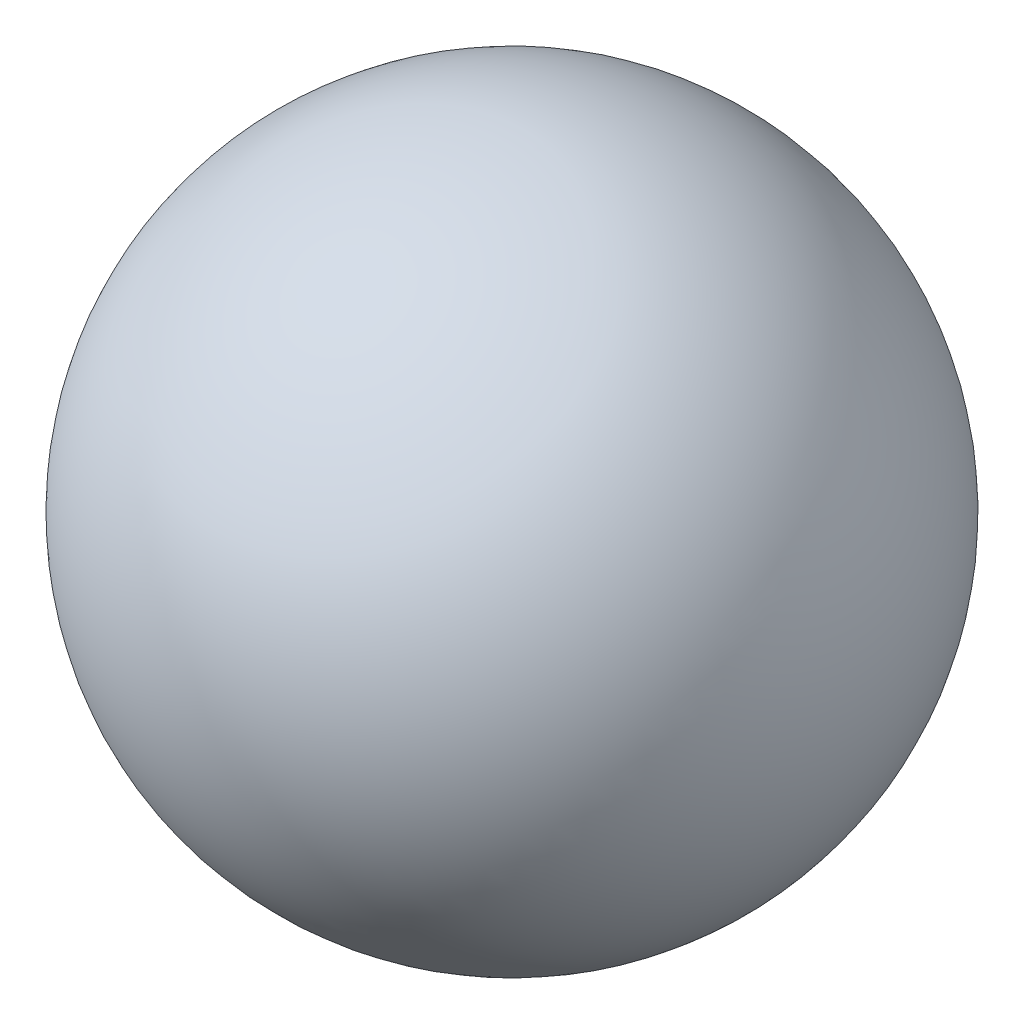
ISO-10303-21;
HEADER;
FILE_DESCRIPTION(('STEP AP214'),'2;1');
FILE_NAME('part.step','',(''),(''),'','','');
FILE_SCHEMA(('AUTOMOTIVE_DESIGN { 1 0 10303 214 1 1 1 1 }'));
ENDSEC;
DATA;
#1=APPLICATION_CONTEXT('core data for automotive mechanical design processes');
#2=APPLICATION_PROTOCOL_DEFINITION('international standard','automotive_design',2000,#1);
#3=PRODUCT_CONTEXT('',#1,'mechanical');
#4=PRODUCT('Part','Part','',(#3));
#5=PRODUCT_RELATED_PRODUCT_CATEGORY('part','',(#4));
#6=PRODUCT_DEFINITION_FORMATION('','',#4);
#7=PRODUCT_DEFINITION_CONTEXT('part definition',#1,'design');
#8=PRODUCT_DEFINITION('design','',#6,#7);
#9=PRODUCT_DEFINITION_SHAPE('','',#8);
#10=(LENGTH_UNIT() NAMED_UNIT(*) SI_UNIT(.MILLI.,.METRE.));
#11=(NAMED_UNIT(*) PLANE_ANGLE_UNIT() SI_UNIT($,.RADIAN.));
#12=(NAMED_UNIT(*) SI_UNIT($,.STERADIAN.) SOLID_ANGLE_UNIT());
#13=UNCERTAINTY_MEASURE_WITH_UNIT(LENGTH_MEASURE(1.E-05),#10,'distance_accuracy_value','');
#14=(GEOMETRIC_REPRESENTATION_CONTEXT(3) GLOBAL_UNCERTAINTY_ASSIGNED_CONTEXT((#13)) GLOBAL_UNIT_ASSIGNED_CONTEXT((#10,
#11,#12)) REPRESENTATION_CONTEXT('',''));
#15=CARTESIAN_POINT('',(0.,0.,0.));
#16=DIRECTION('',(0.,0.,1.));
#17=DIRECTION('',(1.,0.,0.));
#18=AXIS2_PLACEMENT_3D('',#15,#16,#17);
#19=CARTESIAN_POINT('',(67.76,-61.2918611545776,-32.4404610395411));
#20=DIRECTION('',(0.,-0.88383663657057,-0.467795681741101));
#21=DIRECTION('',(0.173648177666933,0.460688814204268,-0.870409172090931));
#22=AXIS2_PLACEMENT_3D('',#19,#20,#21);
#23=SPHERICAL_SURFACE('',#22,7.15);
#24=CARTESIAN_POINT('',(67.76,-54.972429203098,-29.0957219150922));
#25=VERTEX_POINT('',#24);
#26=VERTEX_LOOP('',#25);
#27=FACE_BOUND('',#26,.T.);
#28=CARTESIAN_POINT('',(67.76,-67.6112931060572,-35.78520016399));
#29=VERTEX_POINT('',#28);
#30=VERTEX_LOOP('',#29);
#31=FACE_BOUND('',#30,.T.);
#32=ADVANCED_FACE('F16',(#27,#31),#23,.T.);
#33=CLOSED_SHELL('',(#32));
#34=MANIFOLD_SOLID_BREP('B1',#33);
#35=ADVANCED_BREP_SHAPE_REPRESENTATION('',(#18,#34),#14);
#36=SHAPE_DEFINITION_REPRESENTATION(#9,#35);
ENDSEC;
END-ISO-10303-21;
